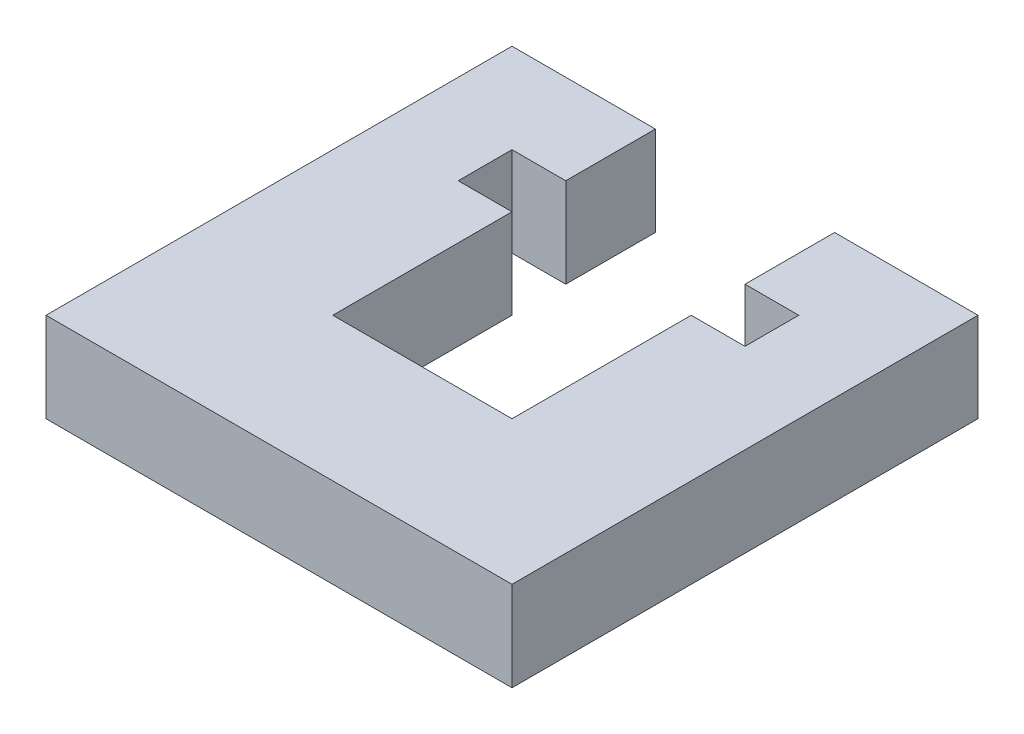
ISO-10303-21;
HEADER;
FILE_DESCRIPTION(('STEP AP214'),'2;1');
FILE_NAME('part.step','',(''),(''),'','','');
FILE_SCHEMA(('AUTOMOTIVE_DESIGN { 1 0 10303 214 1 1 1 1 }'));
ENDSEC;
DATA;
#1=APPLICATION_CONTEXT('core data for automotive mechanical design processes');
#2=APPLICATION_PROTOCOL_DEFINITION('international standard','automotive_design',2000,#1);
#3=PRODUCT_CONTEXT('',#1,'mechanical');
#4=PRODUCT('Part','Part','',(#3));
#5=PRODUCT_RELATED_PRODUCT_CATEGORY('part','',(#4));
#6=PRODUCT_DEFINITION_FORMATION('','',#4);
#7=PRODUCT_DEFINITION_CONTEXT('part definition',#1,'design');
#8=PRODUCT_DEFINITION('design','',#6,#7);
#9=PRODUCT_DEFINITION_SHAPE('','',#8);
#10=(LENGTH_UNIT() NAMED_UNIT(*) SI_UNIT(.MILLI.,.METRE.));
#11=(NAMED_UNIT(*) PLANE_ANGLE_UNIT() SI_UNIT($,.RADIAN.));
#12=(NAMED_UNIT(*) SI_UNIT($,.STERADIAN.) SOLID_ANGLE_UNIT());
#13=UNCERTAINTY_MEASURE_WITH_UNIT(LENGTH_MEASURE(1.E-05),#10,'distance_accuracy_value','');
#14=(GEOMETRIC_REPRESENTATION_CONTEXT(3) GLOBAL_UNCERTAINTY_ASSIGNED_CONTEXT((#13)) GLOBAL_UNIT_ASSIGNED_CONTEXT((#10,
#11,#12)) REPRESENTATION_CONTEXT('',''));
#15=CARTESIAN_POINT('',(0.,0.,0.));
#16=DIRECTION('',(0.,0.,1.));
#17=DIRECTION('',(1.,0.,0.));
#18=AXIS2_PLACEMENT_3D('',#15,#16,#17);
#19=CARTESIAN_POINT('',(8.,5.,-26.));
#20=DIRECTION('',(0.,0.,1.));
#21=DIRECTION('',(1.,0.,0.));
#22=AXIS2_PLACEMENT_3D('',#19,#20,#21);
#23=PLANE('',#22);
#24=DIRECTION('',(-1.,0.,0.));
#25=VECTOR('',#24,1.);
#26=CARTESIAN_POINT('',(8.,0.,-26.));
#27=LINE('',#26,#25);
#28=CARTESIAN_POINT('',(8.,0.,-26.));
#29=VERTEX_POINT('',#28);
#30=CARTESIAN_POINT('',(0.,0.,-26.));
#31=VERTEX_POINT('',#30);
#32=EDGE_CURVE('E179',#29,#31,#27,.T.);
#33=ORIENTED_EDGE('',*,*,#32,.T.);
#34=DIRECTION('',(0.,-1.,0.));
#35=VECTOR('',#34,1.);
#36=CARTESIAN_POINT('',(0.,5.,-26.));
#37=LINE('',#36,#35);
#38=CARTESIAN_POINT('',(0.,5.,-26.));
#39=VERTEX_POINT('',#38);
#40=EDGE_CURVE('E11',#39,#31,#37,.T.);
#41=ORIENTED_EDGE('',*,*,#40,.F.);
#42=DIRECTION('',(-1.,0.,0.));
#43=VECTOR('',#42,1.);
#44=CARTESIAN_POINT('',(8.,5.,-26.));
#45=LINE('',#44,#43);
#46=CARTESIAN_POINT('',(8.,5.,-26.));
#47=VERTEX_POINT('',#46);
#48=EDGE_CURVE('E209',#47,#39,#45,.T.);
#49=ORIENTED_EDGE('',*,*,#48,.F.);
#50=DIRECTION('',(0.,-1.,0.));
#51=VECTOR('',#50,1.);
#52=CARTESIAN_POINT('',(8.,5.,-26.));
#53=LINE('',#52,#51);
#54=EDGE_CURVE('E175',#47,#29,#53,.T.);
#55=ORIENTED_EDGE('',*,*,#54,.T.);
#56=EDGE_LOOP('',(#33,#41,#49,#55));
#57=FACE_BOUND('',#56,.T.);
#58=ADVANCED_FACE('F35',(#57),#23,.F.);
#59=CARTESIAN_POINT('',(0.,5.,-26.));
#60=DIRECTION('',(1.,0.,0.));
#61=DIRECTION('',(0.,0.,-1.));
#62=AXIS2_PLACEMENT_3D('',#59,#60,#61);
#63=PLANE('',#62);
#64=DIRECTION('',(0.,0.,1.));
#65=VECTOR('',#64,1.);
#66=CARTESIAN_POINT('',(0.,0.,-26.));
#67=LINE('',#66,#65);
#68=CARTESIAN_POINT('',(0.,0.,0.));
#69=VERTEX_POINT('',#68);
#70=EDGE_CURVE('E182',#31,#69,#67,.T.);
#71=ORIENTED_EDGE('',*,*,#70,.T.);
#72=DIRECTION('',(0.,-1.,0.));
#73=VECTOR('',#72,1.);
#74=CARTESIAN_POINT('',(0.,5.,0.));
#75=LINE('',#74,#73);
#76=CARTESIAN_POINT('',(0.,5.,0.));
#77=VERTEX_POINT('',#76);
#78=EDGE_CURVE('E43',#77,#69,#75,.T.);
#79=ORIENTED_EDGE('',*,*,#78,.F.);
#80=DIRECTION('',(0.,0.,1.));
#81=VECTOR('',#80,1.);
#82=CARTESIAN_POINT('',(0.,5.,-26.));
#83=LINE('',#82,#81);
#84=EDGE_CURVE('E118',#39,#77,#83,.T.);
#85=ORIENTED_EDGE('',*,*,#84,.F.);
#86=ORIENTED_EDGE('',*,*,#40,.T.);
#87=EDGE_LOOP('',(#71,#79,#85,#86));
#88=FACE_BOUND('',#87,.T.);
#89=ADVANCED_FACE('F307',(#88),#63,.F.);
#90=CARTESIAN_POINT('',(0.,5.,0.));
#91=DIRECTION('',(0.,0.,-1.));
#92=DIRECTION('',(-1.,0.,0.));
#93=AXIS2_PLACEMENT_3D('',#90,#91,#92);
#94=PLANE('',#93);
#95=DIRECTION('',(1.,0.,0.));
#96=VECTOR('',#95,1.);
#97=CARTESIAN_POINT('',(0.,0.,0.));
#98=LINE('',#97,#96);
#99=CARTESIAN_POINT('',(26.,0.,0.));
#100=VERTEX_POINT('',#99);
#101=EDGE_CURVE('E184',#69,#100,#98,.T.);
#102=ORIENTED_EDGE('',*,*,#101,.T.);
#103=DIRECTION('',(0.,-1.,0.));
#104=VECTOR('',#103,1.);
#105=CARTESIAN_POINT('',(26.,5.,0.));
#106=LINE('',#105,#104);
#107=CARTESIAN_POINT('',(26.,5.,0.));
#108=VERTEX_POINT('',#107);
#109=EDGE_CURVE('E240',#108,#100,#106,.T.);
#110=ORIENTED_EDGE('',*,*,#109,.F.);
#111=DIRECTION('',(1.,0.,0.));
#112=VECTOR('',#111,1.);
#113=CARTESIAN_POINT('',(0.,5.,0.));
#114=LINE('',#113,#112);
#115=EDGE_CURVE('E248',#77,#108,#114,.T.);
#116=ORIENTED_EDGE('',*,*,#115,.F.);
#117=ORIENTED_EDGE('',*,*,#78,.T.);
#118=EDGE_LOOP('',(#102,#110,#116,#117));
#119=FACE_BOUND('',#118,.T.);
#120=ADVANCED_FACE('F246',(#119),#94,.F.);
#121=CARTESIAN_POINT('',(26.,5.,0.));
#122=DIRECTION('',(-1.,0.,0.));
#123=DIRECTION('',(0.,0.,1.));
#124=AXIS2_PLACEMENT_3D('',#121,#122,#123);
#125=PLANE('',#124);
#126=DIRECTION('',(0.,0.,-1.));
#127=VECTOR('',#126,1.);
#128=CARTESIAN_POINT('',(26.,0.,0.));
#129=LINE('',#128,#127);
#130=CARTESIAN_POINT('',(26.,0.,-26.));
#131=VERTEX_POINT('',#130);
#132=EDGE_CURVE('E186',#100,#131,#129,.T.);
#133=ORIENTED_EDGE('',*,*,#132,.T.);
#134=DIRECTION('',(0.,-1.,0.));
#135=VECTOR('',#134,1.);
#136=CARTESIAN_POINT('',(26.,5.,-26.));
#137=LINE('',#136,#135);
#138=CARTESIAN_POINT('',(26.,5.,-26.));
#139=VERTEX_POINT('',#138);
#140=EDGE_CURVE('E237',#139,#131,#137,.T.);
#141=ORIENTED_EDGE('',*,*,#140,.F.);
#142=DIRECTION('',(0.,0.,-1.));
#143=VECTOR('',#142,1.);
#144=CARTESIAN_POINT('',(26.,5.,0.));
#145=LINE('',#144,#143);
#146=EDGE_CURVE('E266',#108,#139,#145,.T.);
#147=ORIENTED_EDGE('',*,*,#146,.F.);
#148=ORIENTED_EDGE('',*,*,#109,.T.);
#149=EDGE_LOOP('',(#133,#141,#147,#148));
#150=FACE_BOUND('',#149,.T.);
#151=ADVANCED_FACE('F257',(#150),#125,.F.);
#152=CARTESIAN_POINT('',(26.,5.,-26.));
#153=DIRECTION('',(0.,0.,1.));
#154=DIRECTION('',(1.,0.,0.));
#155=AXIS2_PLACEMENT_3D('',#152,#153,#154);
#156=PLANE('',#155);
#157=DIRECTION('',(-1.,0.,0.));
#158=VECTOR('',#157,1.);
#159=CARTESIAN_POINT('',(26.,0.,-26.));
#160=LINE('',#159,#158);
#161=CARTESIAN_POINT('',(18.,0.,-26.));
#162=VERTEX_POINT('',#161);
#163=EDGE_CURVE('E188',#131,#162,#160,.T.);
#164=ORIENTED_EDGE('',*,*,#163,.T.);
#165=DIRECTION('',(0.,-1.,0.));
#166=VECTOR('',#165,1.);
#167=CARTESIAN_POINT('',(18.,5.,-26.));
#168=LINE('',#167,#166);
#169=CARTESIAN_POINT('',(18.,5.,-26.));
#170=VERTEX_POINT('',#169);
#171=EDGE_CURVE('E234',#170,#162,#168,.T.);
#172=ORIENTED_EDGE('',*,*,#171,.F.);
#173=DIRECTION('',(-1.,0.,0.));
#174=VECTOR('',#173,1.);
#175=CARTESIAN_POINT('',(26.,5.,-26.));
#176=LINE('',#175,#174);
#177=EDGE_CURVE('E263',#139,#170,#176,.T.);
#178=ORIENTED_EDGE('',*,*,#177,.F.);
#179=ORIENTED_EDGE('',*,*,#140,.T.);
#180=EDGE_LOOP('',(#164,#172,#178,#179));
#181=FACE_BOUND('',#180,.T.);
#182=ADVANCED_FACE('F261',(#181),#156,.F.);
#183=CARTESIAN_POINT('',(18.,5.,-26.));
#184=DIRECTION('',(1.,0.,0.));
#185=DIRECTION('',(0.,0.,-1.));
#186=AXIS2_PLACEMENT_3D('',#183,#184,#185);
#187=PLANE('',#186);
#188=DIRECTION('',(0.,0.,1.));
#189=VECTOR('',#188,1.);
#190=CARTESIAN_POINT('',(18.,0.,-26.));
#191=LINE('',#190,#189);
#192=CARTESIAN_POINT('',(18.,0.,-21.));
#193=VERTEX_POINT('',#192);
#194=EDGE_CURVE('E190',#162,#193,#191,.T.);
#195=ORIENTED_EDGE('',*,*,#194,.T.);
#196=DIRECTION('',(0.,-1.,0.));
#197=VECTOR('',#196,1.);
#198=CARTESIAN_POINT('',(18.,5.,-21.));
#199=LINE('',#198,#197);
#200=CARTESIAN_POINT('',(18.,5.,-21.));
#201=VERTEX_POINT('',#200);
#202=EDGE_CURVE('E231',#201,#193,#199,.T.);
#203=ORIENTED_EDGE('',*,*,#202,.F.);
#204=DIRECTION('',(0.,0.,1.));
#205=VECTOR('',#204,1.);
#206=CARTESIAN_POINT('',(18.,5.,-26.));
#207=LINE('',#206,#205);
#208=EDGE_CURVE('E265',#170,#201,#207,.T.);
#209=ORIENTED_EDGE('',*,*,#208,.F.);
#210=ORIENTED_EDGE('',*,*,#171,.T.);
#211=EDGE_LOOP('',(#195,#203,#209,#210));
#212=FACE_BOUND('',#211,.T.);
#213=ADVANCED_FACE('F320',(#212),#187,.F.);
#214=CARTESIAN_POINT('',(21.,5.,-21.));
#215=DIRECTION('',(0.,0.,-1.));
#216=DIRECTION('',(-1.,0.,0.));
#217=AXIS2_PLACEMENT_3D('',#214,#215,#216);
#218=PLANE('',#217);
#219=DIRECTION('',(1.,0.,0.));
#220=VECTOR('',#219,1.);
#221=CARTESIAN_POINT('',(21.,0.,-21.));
#222=LINE('',#221,#220);
#223=CARTESIAN_POINT('',(21.,0.,-21.));
#224=VERTEX_POINT('',#223);
#225=EDGE_CURVE('E192',#193,#224,#222,.T.);
#226=ORIENTED_EDGE('',*,*,#225,.T.);
#227=DIRECTION('',(0.,-1.,0.));
#228=VECTOR('',#227,1.);
#229=CARTESIAN_POINT('',(21.,5.,-21.));
#230=LINE('',#229,#228);
#231=CARTESIAN_POINT('',(21.,5.,-21.));
#232=VERTEX_POINT('',#231);
#233=EDGE_CURVE('E228',#232,#224,#230,.T.);
#234=ORIENTED_EDGE('',*,*,#233,.F.);
#235=DIRECTION('',(1.,0.,0.));
#236=VECTOR('',#235,1.);
#237=CARTESIAN_POINT('',(21.,5.,-21.));
#238=LINE('',#237,#236);
#239=EDGE_CURVE('E268',#201,#232,#238,.T.);
#240=ORIENTED_EDGE('',*,*,#239,.F.);
#241=ORIENTED_EDGE('',*,*,#202,.T.);
#242=EDGE_LOOP('',(#226,#234,#240,#241));
#243=FACE_BOUND('',#242,.T.);
#244=ADVANCED_FACE('F323',(#243),#218,.F.);
#245=CARTESIAN_POINT('',(21.,5.,-21.));
#246=DIRECTION('',(1.,0.,0.));
#247=DIRECTION('',(0.,0.,-1.));
#248=AXIS2_PLACEMENT_3D('',#245,#246,#247);
#249=PLANE('',#248);
#250=DIRECTION('',(0.,0.,1.));
#251=VECTOR('',#250,1.);
#252=CARTESIAN_POINT('',(21.,0.,-21.));
#253=LINE('',#252,#251);
#254=CARTESIAN_POINT('',(21.,0.,-18.));
#255=VERTEX_POINT('',#254);
#256=EDGE_CURVE('E194',#224,#255,#253,.T.);
#257=ORIENTED_EDGE('',*,*,#256,.T.);
#258=DIRECTION('',(0.,-1.,0.));
#259=VECTOR('',#258,1.);
#260=CARTESIAN_POINT('',(21.,5.,-18.));
#261=LINE('',#260,#259);
#262=CARTESIAN_POINT('',(21.,5.,-18.));
#263=VERTEX_POINT('',#262);
#264=EDGE_CURVE('E225',#263,#255,#261,.T.);
#265=ORIENTED_EDGE('',*,*,#264,.F.);
#266=DIRECTION('',(0.,0.,1.));
#267=VECTOR('',#266,1.);
#268=CARTESIAN_POINT('',(21.,5.,-21.));
#269=LINE('',#268,#267);
#270=EDGE_CURVE('E274',#232,#263,#269,.T.);
#271=ORIENTED_EDGE('',*,*,#270,.F.);
#272=ORIENTED_EDGE('',*,*,#233,.T.);
#273=EDGE_LOOP('',(#257,#265,#271,#272));
#274=FACE_BOUND('',#273,.T.);
#275=ADVANCED_FACE('F327',(#274),#249,.F.);
#276=CARTESIAN_POINT('',(21.,5.,-18.));
#277=DIRECTION('',(0.,0.,1.));
#278=DIRECTION('',(1.,0.,0.));
#279=AXIS2_PLACEMENT_3D('',#276,#277,#278);
#280=PLANE('',#279);
#281=DIRECTION('',(-1.,0.,0.));
#282=VECTOR('',#281,1.);
#283=CARTESIAN_POINT('',(21.,0.,-18.));
#284=LINE('',#283,#282);
#285=CARTESIAN_POINT('',(18.,0.,-18.));
#286=VERTEX_POINT('',#285);
#287=EDGE_CURVE('E196',#255,#286,#284,.T.);
#288=ORIENTED_EDGE('',*,*,#287,.T.);
#289=DIRECTION('',(0.,-1.,0.));
#290=VECTOR('',#289,1.);
#291=CARTESIAN_POINT('',(18.,5.,-18.));
#292=LINE('',#291,#290);
#293=CARTESIAN_POINT('',(18.,5.,-18.));
#294=VERTEX_POINT('',#293);
#295=EDGE_CURVE('E222',#294,#286,#292,.T.);
#296=ORIENTED_EDGE('',*,*,#295,.F.);
#297=DIRECTION('',(-1.,0.,0.));
#298=VECTOR('',#297,1.);
#299=CARTESIAN_POINT('',(21.,5.,-18.));
#300=LINE('',#299,#298);
#301=EDGE_CURVE('E276',#263,#294,#300,.T.);
#302=ORIENTED_EDGE('',*,*,#301,.F.);
#303=ORIENTED_EDGE('',*,*,#264,.T.);
#304=EDGE_LOOP('',(#288,#296,#302,#303));
#305=FACE_BOUND('',#304,.T.);
#306=ADVANCED_FACE('F331',(#305),#280,.F.);
#307=CARTESIAN_POINT('',(18.,5.,-18.));
#308=DIRECTION('',(1.,0.,0.));
#309=DIRECTION('',(0.,0.,-1.));
#310=AXIS2_PLACEMENT_3D('',#307,#308,#309);
#311=PLANE('',#310);
#312=DIRECTION('',(0.,0.,1.));
#313=VECTOR('',#312,1.);
#314=CARTESIAN_POINT('',(18.,0.,-18.));
#315=LINE('',#314,#313);
#316=CARTESIAN_POINT('',(18.,0.,-8.));
#317=VERTEX_POINT('',#316);
#318=EDGE_CURVE('E198',#286,#317,#315,.T.);
#319=ORIENTED_EDGE('',*,*,#318,.T.);
#320=DIRECTION('',(0.,-1.,0.));
#321=VECTOR('',#320,1.);
#322=CARTESIAN_POINT('',(18.,5.,-8.));
#323=LINE('',#322,#321);
#324=CARTESIAN_POINT('',(18.,5.,-8.));
#325=VERTEX_POINT('',#324);
#326=EDGE_CURVE('E219',#325,#317,#323,.T.);
#327=ORIENTED_EDGE('',*,*,#326,.F.);
#328=DIRECTION('',(0.,0.,1.));
#329=VECTOR('',#328,1.);
#330=CARTESIAN_POINT('',(18.,5.,-18.));
#331=LINE('',#330,#329);
#332=EDGE_CURVE('E278',#294,#325,#331,.T.);
#333=ORIENTED_EDGE('',*,*,#332,.F.);
#334=ORIENTED_EDGE('',*,*,#295,.T.);
#335=EDGE_LOOP('',(#319,#327,#333,#334));
#336=FACE_BOUND('',#335,.T.);
#337=ADVANCED_FACE('F335',(#336),#311,.F.);
#338=CARTESIAN_POINT('',(18.,5.,-8.));
#339=DIRECTION('',(0.,0.,1.));
#340=DIRECTION('',(1.,0.,0.));
#341=AXIS2_PLACEMENT_3D('',#338,#339,#340);
#342=PLANE('',#341);
#343=DIRECTION('',(-1.,0.,0.));
#344=VECTOR('',#343,1.);
#345=CARTESIAN_POINT('',(18.,0.,-8.));
#346=LINE('',#345,#344);
#347=CARTESIAN_POINT('',(8.,0.,-8.));
#348=VERTEX_POINT('',#347);
#349=EDGE_CURVE('E200',#317,#348,#346,.T.);
#350=ORIENTED_EDGE('',*,*,#349,.T.);
#351=DIRECTION('',(0.,-1.,0.));
#352=VECTOR('',#351,1.);
#353=CARTESIAN_POINT('',(8.,5.,-8.));
#354=LINE('',#353,#352);
#355=CARTESIAN_POINT('',(8.,5.,-8.));
#356=VERTEX_POINT('',#355);
#357=EDGE_CURVE('E216',#356,#348,#354,.T.);
#358=ORIENTED_EDGE('',*,*,#357,.F.);
#359=DIRECTION('',(-1.,0.,0.));
#360=VECTOR('',#359,1.);
#361=CARTESIAN_POINT('',(18.,5.,-8.));
#362=LINE('',#361,#360);
#363=EDGE_CURVE('E280',#325,#356,#362,.T.);
#364=ORIENTED_EDGE('',*,*,#363,.F.);
#365=ORIENTED_EDGE('',*,*,#326,.T.);
#366=EDGE_LOOP('',(#350,#358,#364,#365));
#367=FACE_BOUND('',#366,.T.);
#368=ADVANCED_FACE('F339',(#367),#342,.F.);
#369=CARTESIAN_POINT('',(8.,5.,-8.));
#370=DIRECTION('',(-1.,0.,0.));
#371=DIRECTION('',(0.,0.,1.));
#372=AXIS2_PLACEMENT_3D('',#369,#370,#371);
#373=PLANE('',#372);
#374=DIRECTION('',(0.,0.,-1.));
#375=VECTOR('',#374,1.);
#376=CARTESIAN_POINT('',(8.,0.,-8.));
#377=LINE('',#376,#375);
#378=CARTESIAN_POINT('',(8.,0.,-18.));
#379=VERTEX_POINT('',#378);
#380=EDGE_CURVE('E202',#348,#379,#377,.T.);
#381=ORIENTED_EDGE('',*,*,#380,.T.);
#382=DIRECTION('',(0.,-1.,0.));
#383=VECTOR('',#382,1.);
#384=CARTESIAN_POINT('',(8.,5.,-18.));
#385=LINE('',#384,#383);
#386=CARTESIAN_POINT('',(8.,5.,-18.));
#387=VERTEX_POINT('',#386);
#388=EDGE_CURVE('E213',#387,#379,#385,.T.);
#389=ORIENTED_EDGE('',*,*,#388,.F.);
#390=DIRECTION('',(0.,0.,-1.));
#391=VECTOR('',#390,1.);
#392=CARTESIAN_POINT('',(8.,5.,-8.));
#393=LINE('',#392,#391);
#394=EDGE_CURVE('E282',#356,#387,#393,.T.);
#395=ORIENTED_EDGE('',*,*,#394,.F.);
#396=ORIENTED_EDGE('',*,*,#357,.T.);
#397=EDGE_LOOP('',(#381,#389,#395,#396));
#398=FACE_BOUND('',#397,.T.);
#399=ADVANCED_FACE('F288',(#398),#373,.F.);
#400=CARTESIAN_POINT('',(8.,5.,-18.));
#401=DIRECTION('',(0.,0.,1.));
#402=DIRECTION('',(1.,0.,0.));
#403=AXIS2_PLACEMENT_3D('',#400,#401,#402);
#404=PLANE('',#403);
#405=DIRECTION('',(-1.,0.,0.));
#406=VECTOR('',#405,1.);
#407=CARTESIAN_POINT('',(8.,0.,-18.));
#408=LINE('',#407,#406);
#409=CARTESIAN_POINT('',(5.,0.,-18.));
#410=VERTEX_POINT('',#409);
#411=EDGE_CURVE('E204',#379,#410,#408,.T.);
#412=ORIENTED_EDGE('',*,*,#411,.T.);
#413=DIRECTION('',(0.,-1.,0.));
#414=VECTOR('',#413,1.);
#415=CARTESIAN_POINT('',(5.,5.,-18.));
#416=LINE('',#415,#414);
#417=CARTESIAN_POINT('',(5.,5.,-18.));
#418=VERTEX_POINT('',#417);
#419=EDGE_CURVE('E170',#418,#410,#416,.T.);
#420=ORIENTED_EDGE('',*,*,#419,.F.);
#421=DIRECTION('',(-1.,0.,0.));
#422=VECTOR('',#421,1.);
#423=CARTESIAN_POINT('',(8.,5.,-18.));
#424=LINE('',#423,#422);
#425=EDGE_CURVE('E161',#387,#418,#424,.T.);
#426=ORIENTED_EDGE('',*,*,#425,.F.);
#427=ORIENTED_EDGE('',*,*,#388,.T.);
#428=EDGE_LOOP('',(#412,#420,#426,#427));
#429=FACE_BOUND('',#428,.T.);
#430=ADVANCED_FACE('F292',(#429),#404,.F.);
#431=CARTESIAN_POINT('',(5.,5.,-21.));
#432=DIRECTION('',(-1.,0.,0.));
#433=DIRECTION('',(0.,0.,1.));
#434=AXIS2_PLACEMENT_3D('',#431,#432,#433);
#435=PLANE('',#434);
#436=DIRECTION('',(0.,0.,-1.));
#437=VECTOR('',#436,1.);
#438=CARTESIAN_POINT('',(5.,0.,-21.));
#439=LINE('',#438,#437);
#440=CARTESIAN_POINT('',(5.,0.,-21.));
#441=VERTEX_POINT('',#440);
#442=EDGE_CURVE('E169',#410,#441,#439,.T.);
#443=ORIENTED_EDGE('',*,*,#442,.T.);
#444=DIRECTION('',(0.,-1.,0.));
#445=VECTOR('',#444,1.);
#446=CARTESIAN_POINT('',(5.,5.,-21.));
#447=LINE('',#446,#445);
#448=CARTESIAN_POINT('',(5.,5.,-21.));
#449=VERTEX_POINT('',#448);
#450=EDGE_CURVE('E166',#449,#441,#447,.T.);
#451=ORIENTED_EDGE('',*,*,#450,.F.);
#452=DIRECTION('',(0.,0.,-1.));
#453=VECTOR('',#452,1.);
#454=CARTESIAN_POINT('',(5.,5.,-21.));
#455=LINE('',#454,#453);
#456=EDGE_CURVE('E155',#418,#449,#455,.T.);
#457=ORIENTED_EDGE('',*,*,#456,.F.);
#458=ORIENTED_EDGE('',*,*,#419,.T.);
#459=EDGE_LOOP('',(#443,#451,#457,#458));
#460=FACE_BOUND('',#459,.T.);
#461=ADVANCED_FACE('F167',(#460),#435,.F.);
#462=CARTESIAN_POINT('',(8.,5.,-21.));
#463=DIRECTION('',(0.,0.,-1.));
#464=DIRECTION('',(-1.,0.,0.));
#465=AXIS2_PLACEMENT_3D('',#462,#463,#464);
#466=PLANE('',#465);
#467=DIRECTION('',(1.,0.,0.));
#468=VECTOR('',#467,1.);
#469=CARTESIAN_POINT('',(8.,0.,-21.));
#470=LINE('',#469,#468);
#471=CARTESIAN_POINT('',(8.,0.,-21.));
#472=VERTEX_POINT('',#471);
#473=EDGE_CURVE('E104',#441,#472,#470,.T.);
#474=ORIENTED_EDGE('',*,*,#473,.T.);
#475=DIRECTION('',(0.,-1.,0.));
#476=VECTOR('',#475,1.);
#477=CARTESIAN_POINT('',(8.,5.,-21.));
#478=LINE('',#477,#476);
#479=CARTESIAN_POINT('',(8.,5.,-21.));
#480=VERTEX_POINT('',#479);
#481=EDGE_CURVE('E171',#480,#472,#478,.T.);
#482=ORIENTED_EDGE('',*,*,#481,.F.);
#483=DIRECTION('',(1.,0.,0.));
#484=VECTOR('',#483,1.);
#485=CARTESIAN_POINT('',(8.,5.,-21.));
#486=LINE('',#485,#484);
#487=EDGE_CURVE('E159',#449,#480,#486,.T.);
#488=ORIENTED_EDGE('',*,*,#487,.F.);
#489=ORIENTED_EDGE('',*,*,#450,.T.);
#490=EDGE_LOOP('',(#474,#482,#488,#489));
#491=FACE_BOUND('',#490,.T.);
#492=ADVANCED_FACE('F173',(#491),#466,.F.);
#493=CARTESIAN_POINT('',(8.,5.,-21.));
#494=DIRECTION('',(-1.,0.,0.));
#495=DIRECTION('',(0.,0.,1.));
#496=AXIS2_PLACEMENT_3D('',#493,#494,#495);
#497=PLANE('',#496);
#498=DIRECTION('',(0.,0.,-1.));
#499=VECTOR('',#498,1.);
#500=CARTESIAN_POINT('',(8.,0.,-21.));
#501=LINE('',#500,#499);
#502=EDGE_CURVE('E110',#472,#29,#501,.T.);
#503=ORIENTED_EDGE('',*,*,#502,.T.);
#504=ORIENTED_EDGE('',*,*,#54,.F.);
#505=DIRECTION('',(0.,0.,-1.));
#506=VECTOR('',#505,1.);
#507=CARTESIAN_POINT('',(8.,5.,-21.));
#508=LINE('',#507,#506);
#509=EDGE_CURVE('E51',#480,#47,#508,.T.);
#510=ORIENTED_EDGE('',*,*,#509,.F.);
#511=ORIENTED_EDGE('',*,*,#481,.T.);
#512=EDGE_LOOP('',(#503,#504,#510,#511));
#513=FACE_BOUND('',#512,.T.);
#514=ADVANCED_FACE('F296',(#513),#497,.F.);
#515=CARTESIAN_POINT('',(0.,5.,0.));
#516=DIRECTION('',(0.,1.,0.));
#517=DIRECTION('',(0.,0.,1.));
#518=AXIS2_PLACEMENT_3D('',#515,#516,#517);
#519=PLANE('',#518);
#520=ORIENTED_EDGE('',*,*,#48,.T.);
#521=ORIENTED_EDGE('',*,*,#84,.T.);
#522=ORIENTED_EDGE('',*,*,#115,.T.);
#523=ORIENTED_EDGE('',*,*,#146,.T.);
#524=ORIENTED_EDGE('',*,*,#177,.T.);
#525=ORIENTED_EDGE('',*,*,#208,.T.);
#526=ORIENTED_EDGE('',*,*,#239,.T.);
#527=ORIENTED_EDGE('',*,*,#270,.T.);
#528=ORIENTED_EDGE('',*,*,#301,.T.);
#529=ORIENTED_EDGE('',*,*,#332,.T.);
#530=ORIENTED_EDGE('',*,*,#363,.T.);
#531=ORIENTED_EDGE('',*,*,#394,.T.);
#532=ORIENTED_EDGE('',*,*,#425,.T.);
#533=ORIENTED_EDGE('',*,*,#456,.T.);
#534=ORIENTED_EDGE('',*,*,#487,.T.);
#535=ORIENTED_EDGE('',*,*,#509,.T.);
#536=EDGE_LOOP('',(#520,#521,#522,#523,#524,#525,#526,#527,#528,#529,#530,#531,#532,#533,#534,#535));
#537=FACE_BOUND('',#536,.T.);
#538=ADVANCED_FACE('F157',(#537),#519,.T.);
#539=CARTESIAN_POINT('',(0.,0.,0.));
#540=DIRECTION('',(0.,1.,0.));
#541=DIRECTION('',(0.,0.,1.));
#542=AXIS2_PLACEMENT_3D('',#539,#540,#541);
#543=PLANE('',#542);
#544=ORIENTED_EDGE('',*,*,#32,.F.);
#545=ORIENTED_EDGE('',*,*,#502,.F.);
#546=ORIENTED_EDGE('',*,*,#473,.F.);
#547=ORIENTED_EDGE('',*,*,#442,.F.);
#548=ORIENTED_EDGE('',*,*,#411,.F.);
#549=ORIENTED_EDGE('',*,*,#380,.F.);
#550=ORIENTED_EDGE('',*,*,#349,.F.);
#551=ORIENTED_EDGE('',*,*,#318,.F.);
#552=ORIENTED_EDGE('',*,*,#287,.F.);
#553=ORIENTED_EDGE('',*,*,#256,.F.);
#554=ORIENTED_EDGE('',*,*,#225,.F.);
#555=ORIENTED_EDGE('',*,*,#194,.F.);
#556=ORIENTED_EDGE('',*,*,#163,.F.);
#557=ORIENTED_EDGE('',*,*,#132,.F.);
#558=ORIENTED_EDGE('',*,*,#101,.F.);
#559=ORIENTED_EDGE('',*,*,#70,.F.);
#560=EDGE_LOOP('',(#544,#545,#546,#547,#548,#549,#550,#551,#552,#553,#554,#555,#556,#557,#558,#559));
#561=FACE_BOUND('',#560,.T.);
#562=ADVANCED_FACE('F252',(#561),#543,.F.);
#563=CLOSED_SHELL('',(#58,#89,#120,#151,#182,#213,#244,#275,#306,#337,#368,#399,#430,#461,#492,
#514,#538,#562));
#564=MANIFOLD_SOLID_BREP('B2',#563);
#565=ADVANCED_BREP_SHAPE_REPRESENTATION('',(#18,#564),#14);
#566=SHAPE_DEFINITION_REPRESENTATION(#9,#565);
ENDSEC;
END-ISO-10303-21;
